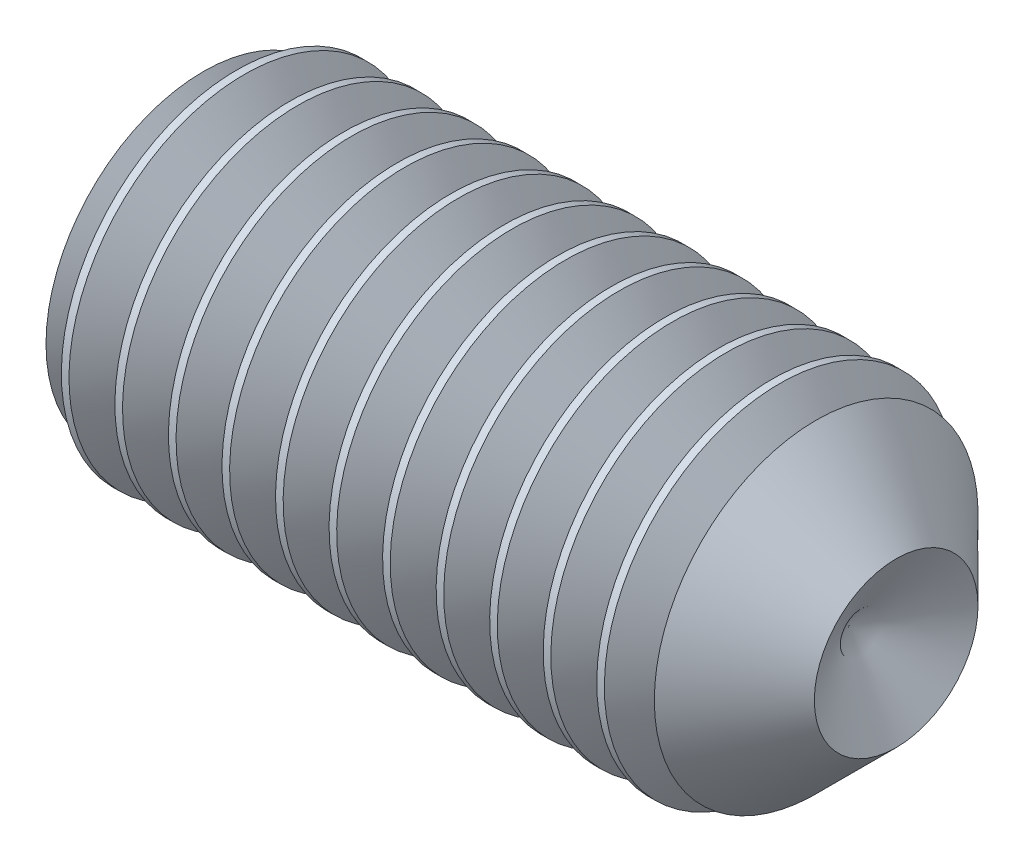
ISO-10303-21;
HEADER;
FILE_DESCRIPTION(('STEP AP214'),'2;1');
FILE_NAME('part.step','',(''),(''),'','','');
FILE_SCHEMA(('AUTOMOTIVE_DESIGN { 1 0 10303 214 1 1 1 1 }'));
ENDSEC;
DATA;
#1=APPLICATION_CONTEXT('core data for automotive mechanical design processes');
#2=APPLICATION_PROTOCOL_DEFINITION('international standard','automotive_design',2000,#1);
#3=PRODUCT_CONTEXT('',#1,'mechanical');
#4=PRODUCT('Part','Part','',(#3));
#5=PRODUCT_RELATED_PRODUCT_CATEGORY('part','',(#4));
#6=PRODUCT_DEFINITION_FORMATION('','',#4);
#7=PRODUCT_DEFINITION_CONTEXT('part definition',#1,'design');
#8=PRODUCT_DEFINITION('design','',#6,#7);
#9=PRODUCT_DEFINITION_SHAPE('','',#8);
#10=(LENGTH_UNIT() NAMED_UNIT(*) SI_UNIT(.MILLI.,.METRE.));
#11=(NAMED_UNIT(*) PLANE_ANGLE_UNIT() SI_UNIT($,.RADIAN.));
#12=(NAMED_UNIT(*) SI_UNIT($,.STERADIAN.) SOLID_ANGLE_UNIT());
#13=UNCERTAINTY_MEASURE_WITH_UNIT(LENGTH_MEASURE(1.E-05),#10,'distance_accuracy_value','');
#14=(GEOMETRIC_REPRESENTATION_CONTEXT(3) GLOBAL_UNCERTAINTY_ASSIGNED_CONTEXT((#13)) GLOBAL_UNIT_ASSIGNED_CONTEXT((#10,
#11,#12)) REPRESENTATION_CONTEXT('',''));
#15=CARTESIAN_POINT('',(0.,0.,0.));
#16=DIRECTION('',(0.,0.,1.));
#17=DIRECTION('',(1.,0.,0.));
#18=AXIS2_PLACEMENT_3D('',#15,#16,#17);
#19=CARTESIAN_POINT('',(0.,0.,0.));
#20=DIRECTION('',(-1.,0.,0.));
#21=DIRECTION('',(0.,0.,1.));
#22=AXIS2_PLACEMENT_3D('',#19,#20,#21);
#23=PLANE('',#22);
#24=CARTESIAN_POINT('',(0.,0.,0.));
#25=DIRECTION('',(-1.,0.,0.));
#26=DIRECTION('',(0.,0.,1.));
#27=AXIS2_PLACEMENT_3D('',#24,#25,#26);
#28=CIRCLE('',#27,1.2195);
#29=CARTESIAN_POINT('',(0.,0.,1.2195));
#30=VERTEX_POINT('',#29);
#31=EDGE_CURVE('E11',#30,#30,#28,.T.);
#32=ORIENTED_EDGE('',*,*,#31,.T.);
#33=EDGE_LOOP('',(#32));
#34=FACE_BOUND('',#33,.T.);
#35=DIRECTION('',(0.,0.,-1.));
#36=VECTOR('',#35,1.);
#37=CARTESIAN_POINT('',(0.,0.750000000000003,0.433012701892217));
#38=LINE('',#37,#36);
#39=CARTESIAN_POINT('',(0.,0.750000000000003,0.433012701892217));
#40=VERTEX_POINT('',#39);
#41=CARTESIAN_POINT('',(0.,0.750000000000003,-0.433012701892222));
#42=VERTEX_POINT('',#41);
#43=EDGE_CURVE('E99',#40,#42,#38,.T.);
#44=ORIENTED_EDGE('',*,*,#43,.F.);
#45=DIRECTION('',(0.,-0.866025403784439,0.5));
#46=VECTOR('',#45,1.);
#47=CARTESIAN_POINT('',(0.,0.750000000000003,0.433012701892217));
#48=LINE('',#47,#46);
#49=CARTESIAN_POINT('',(0.,0.,0.866025403784436));
#50=VERTEX_POINT('',#49);
#51=EDGE_CURVE('E52',#40,#50,#48,.T.);
#52=ORIENTED_EDGE('',*,*,#51,.T.);
#53=DIRECTION('',(0.,0.866025403784439,0.5));
#54=VECTOR('',#53,1.);
#55=CARTESIAN_POINT('',(0.,-0.749999999999997,0.433012701892217));
#56=LINE('',#55,#54);
#57=CARTESIAN_POINT('',(0.,-0.749999999999997,0.433012701892217));
#58=VERTEX_POINT('',#57);
#59=EDGE_CURVE('E105',#58,#50,#56,.T.);
#60=ORIENTED_EDGE('',*,*,#59,.F.);
#61=DIRECTION('',(0.,0.,-1.));
#62=VECTOR('',#61,1.);
#63=CARTESIAN_POINT('',(0.,-0.749999999999997,0.433012701892217));
#64=LINE('',#63,#62);
#65=CARTESIAN_POINT('',(0.,-0.749999999999997,-0.433012701892222));
#66=VERTEX_POINT('',#65);
#67=EDGE_CURVE('E126',#58,#66,#64,.T.);
#68=ORIENTED_EDGE('',*,*,#67,.T.);
#69=DIRECTION('',(0.,0.866025403784438,-0.5));
#70=VECTOR('',#69,1.);
#71=CARTESIAN_POINT('',(0.,-0.749999999999997,-0.433012701892222));
#72=LINE('',#71,#70);
#73=CARTESIAN_POINT('',(0.,0.,-0.866025403784442));
#74=VERTEX_POINT('',#73);
#75=EDGE_CURVE('E129',#66,#74,#72,.T.);
#76=ORIENTED_EDGE('',*,*,#75,.T.);
#77=DIRECTION('',(0.,-0.866025403784439,-0.5));
#78=VECTOR('',#77,1.);
#79=CARTESIAN_POINT('',(0.,0.750000000000003,-0.433012701892222));
#80=LINE('',#79,#78);
#81=EDGE_CURVE('E132',#42,#74,#80,.T.);
#82=ORIENTED_EDGE('',*,*,#81,.F.);
#83=EDGE_LOOP('',(#44,#52,#60,#68,#76,#82));
#84=FACE_BOUND('',#83,.T.);
#85=ADVANCED_FACE('F36',(#34,#84),#23,.T.);
#86=CARTESIAN_POINT('',(0.,0.,0.));
#87=DIRECTION('',(1.,0.,0.));
#88=DIRECTION('',(0.,0.,-1.));
#89=AXIS2_PLACEMENT_3D('',#86,#87,#88);
#90=CONICAL_SURFACE('',#89,1.2195,1.0471975511966);
#91=CARTESIAN_POINT('',(0.0731865121550397,0.,0.));
#92=DIRECTION('',(-1.,0.,0.));
#93=DIRECTION('',(0.,-1.,0.));
#94=AXIS2_PLACEMENT_3D('',#91,#92,#93);
#95=CIRCLE('',#94,1.34626275748129);
#96=CARTESIAN_POINT('',(0.0731865121550398,-1.34626275748129,0.));
#97=VERTEX_POINT('',#96);
#98=EDGE_CURVE('E124',#97,#97,#95,.F.);
#99=ORIENTED_EDGE('',*,*,#98,.F.);
#100=EDGE_LOOP('',(#99));
#101=FACE_BOUND('',#100,.T.);
#102=ORIENTED_EDGE('',*,*,#31,.F.);
#103=EDGE_LOOP('',(#102));
#104=FACE_BOUND('',#103,.T.);
#105=ADVANCED_FACE('F276',(#101,#104),#90,.T.);
#106=CARTESIAN_POINT('',(2.,0.750000000000003,0.433012701892217));
#107=DIRECTION('',(0.,-0.5,-0.866025403784439));
#108=DIRECTION('',(0.,0.866025403784439,-0.5));
#109=AXIS2_PLACEMENT_3D('',#106,#107,#108);
#110=PLANE('',#109);
#111=ORIENTED_EDGE('',*,*,#51,.F.);
#112=DIRECTION('',(-1.,0.,0.));
#113=VECTOR('',#112,1.);
#114=CARTESIAN_POINT('',(2.,0.750000000000003,0.433012701892217));
#115=LINE('',#114,#113);
#116=CARTESIAN_POINT('',(2.,0.750000000000003,0.433012701892217));
#117=VERTEX_POINT('',#116);
#118=EDGE_CURVE('E93',#117,#40,#115,.T.);
#119=ORIENTED_EDGE('',*,*,#118,.F.);
#120=DIRECTION('',(0.,-0.866025403784439,0.5));
#121=VECTOR('',#120,1.);
#122=CARTESIAN_POINT('',(2.,0.750000000000003,0.433012701892217));
#123=LINE('',#122,#121);
#124=CARTESIAN_POINT('',(2.,0.,0.866025403784436));
#125=VERTEX_POINT('',#124);
#126=EDGE_CURVE('E88',#117,#125,#123,.T.);
#127=ORIENTED_EDGE('',*,*,#126,.T.);
#128=DIRECTION('',(-1.,0.,0.));
#129=VECTOR('',#128,1.);
#130=CARTESIAN_POINT('',(2.,0.,0.866025403784436));
#131=LINE('',#130,#129);
#132=EDGE_CURVE('E91',#125,#50,#131,.T.);
#133=ORIENTED_EDGE('',*,*,#132,.T.);
#134=EDGE_LOOP('',(#111,#119,#127,#133));
#135=FACE_BOUND('',#134,.T.);
#136=ADVANCED_FACE('F90',(#135),#110,.T.);
#137=CARTESIAN_POINT('',(2.,-0.749999999999997,0.433012701892217));
#138=DIRECTION('',(0.,-0.5,0.866025403784439));
#139=DIRECTION('',(0.,-0.866025403784439,-0.5));
#140=AXIS2_PLACEMENT_3D('',#137,#138,#139);
#141=PLANE('',#140);
#142=ORIENTED_EDGE('',*,*,#59,.T.);
#143=ORIENTED_EDGE('',*,*,#132,.F.);
#144=DIRECTION('',(0.,0.866025403784439,0.5));
#145=VECTOR('',#144,1.);
#146=CARTESIAN_POINT('',(2.,-0.749999999999997,0.433012701892217));
#147=LINE('',#146,#145);
#148=CARTESIAN_POINT('',(2.,-0.749999999999997,0.433012701892217));
#149=VERTEX_POINT('',#148);
#150=EDGE_CURVE('E98',#149,#125,#147,.T.);
#151=ORIENTED_EDGE('',*,*,#150,.F.);
#152=DIRECTION('',(-1.,0.,0.));
#153=VECTOR('',#152,1.);
#154=CARTESIAN_POINT('',(2.,-0.749999999999997,0.433012701892217));
#155=LINE('',#154,#153);
#156=EDGE_CURVE('E106',#149,#58,#155,.T.);
#157=ORIENTED_EDGE('',*,*,#156,.T.);
#158=EDGE_LOOP('',(#142,#143,#151,#157));
#159=FACE_BOUND('',#158,.T.);
#160=ADVANCED_FACE('F103',(#159),#141,.F.);
#161=CARTESIAN_POINT('',(2.,-0.749999999999997,0.433012701892217));
#162=DIRECTION('',(0.,1.,0.));
#163=DIRECTION('',(0.,0.,1.));
#164=AXIS2_PLACEMENT_3D('',#161,#162,#163);
#165=PLANE('',#164);
#166=ORIENTED_EDGE('',*,*,#67,.F.);
#167=ORIENTED_EDGE('',*,*,#156,.F.);
#168=DIRECTION('',(0.,0.,-1.));
#169=VECTOR('',#168,1.);
#170=CARTESIAN_POINT('',(2.,-0.749999999999997,0.433012701892217));
#171=LINE('',#170,#169);
#172=CARTESIAN_POINT('',(2.,-0.749999999999997,-0.433012701892222));
#173=VERTEX_POINT('',#172);
#174=EDGE_CURVE('E111',#149,#173,#171,.T.);
#175=ORIENTED_EDGE('',*,*,#174,.T.);
#176=DIRECTION('',(-1.,0.,0.));
#177=VECTOR('',#176,1.);
#178=CARTESIAN_POINT('',(2.,-0.749999999999997,-0.433012701892222));
#179=LINE('',#178,#177);
#180=EDGE_CURVE('E142',#173,#66,#179,.T.);
#181=ORIENTED_EDGE('',*,*,#180,.T.);
#182=EDGE_LOOP('',(#166,#167,#175,#181));
#183=FACE_BOUND('',#182,.T.);
#184=ADVANCED_FACE('F298',(#183),#165,.T.);
#185=CARTESIAN_POINT('',(2.,-0.749999999999997,-0.433012701892222));
#186=DIRECTION('',(0.,0.5,0.866025403784438));
#187=DIRECTION('',(0.,-0.866025403784439,0.5));
#188=AXIS2_PLACEMENT_3D('',#185,#186,#187);
#189=PLANE('',#188);
#190=ORIENTED_EDGE('',*,*,#75,.F.);
#191=ORIENTED_EDGE('',*,*,#180,.F.);
#192=DIRECTION('',(0.,0.866025403784438,-0.5));
#193=VECTOR('',#192,1.);
#194=CARTESIAN_POINT('',(2.,-0.749999999999997,-0.433012701892222));
#195=LINE('',#194,#193);
#196=CARTESIAN_POINT('',(2.,0.,-0.866025403784442));
#197=VERTEX_POINT('',#196);
#198=EDGE_CURVE('E113',#173,#197,#195,.T.);
#199=ORIENTED_EDGE('',*,*,#198,.T.);
#200=DIRECTION('',(-1.,0.,0.));
#201=VECTOR('',#200,1.);
#202=CARTESIAN_POINT('',(2.,0.,-0.866025403784442));
#203=LINE('',#202,#201);
#204=EDGE_CURVE('E140',#197,#74,#203,.T.);
#205=ORIENTED_EDGE('',*,*,#204,.T.);
#206=EDGE_LOOP('',(#190,#191,#199,#205));
#207=FACE_BOUND('',#206,.T.);
#208=ADVANCED_FACE('F294',(#207),#189,.T.);
#209=CARTESIAN_POINT('',(2.,0.750000000000003,-0.433012701892222));
#210=DIRECTION('',(0.,0.5,-0.866025403784439));
#211=DIRECTION('',(0.,0.866025403784439,0.5));
#212=AXIS2_PLACEMENT_3D('',#209,#210,#211);
#213=PLANE('',#212);
#214=ORIENTED_EDGE('',*,*,#81,.T.);
#215=ORIENTED_EDGE('',*,*,#204,.F.);
#216=DIRECTION('',(0.,-0.866025403784439,-0.5));
#217=VECTOR('',#216,1.);
#218=CARTESIAN_POINT('',(2.,0.750000000000003,-0.433012701892222));
#219=LINE('',#218,#217);
#220=CARTESIAN_POINT('',(2.,0.750000000000003,-0.433012701892222));
#221=VERTEX_POINT('',#220);
#222=EDGE_CURVE('E118',#221,#197,#219,.T.);
#223=ORIENTED_EDGE('',*,*,#222,.F.);
#224=DIRECTION('',(-1.,0.,0.));
#225=VECTOR('',#224,1.);
#226=CARTESIAN_POINT('',(2.,0.750000000000003,-0.433012701892222));
#227=LINE('',#226,#225);
#228=EDGE_CURVE('E138',#221,#42,#227,.T.);
#229=ORIENTED_EDGE('',*,*,#228,.T.);
#230=EDGE_LOOP('',(#214,#215,#223,#229));
#231=FACE_BOUND('',#230,.T.);
#232=ADVANCED_FACE('F291',(#231),#213,.F.);
#233=CARTESIAN_POINT('',(2.,0.750000000000003,0.433012701892217));
#234=DIRECTION('',(0.,1.,0.));
#235=DIRECTION('',(0.,0.,1.));
#236=AXIS2_PLACEMENT_3D('',#233,#234,#235);
#237=PLANE('',#236);
#238=ORIENTED_EDGE('',*,*,#43,.T.);
#239=ORIENTED_EDGE('',*,*,#228,.F.);
#240=DIRECTION('',(0.,0.,-1.));
#241=VECTOR('',#240,1.);
#242=CARTESIAN_POINT('',(2.,0.750000000000003,0.433012701892217));
#243=LINE('',#242,#241);
#244=EDGE_CURVE('E121',#117,#221,#243,.T.);
#245=ORIENTED_EDGE('',*,*,#244,.F.);
#246=ORIENTED_EDGE('',*,*,#118,.T.);
#247=EDGE_LOOP('',(#238,#239,#245,#246));
#248=FACE_BOUND('',#247,.T.);
#249=ADVANCED_FACE('F287',(#248),#237,.F.);
#250=CARTESIAN_POINT('',(2.,-0.749999999999997,1.29903810567666));
#251=DIRECTION('',(1.,0.,0.));
#252=DIRECTION('',(0.,0.,-1.));
#253=AXIS2_PLACEMENT_3D('',#250,#251,#252);
#254=PLANE('',#253);
#255=ORIENTED_EDGE('',*,*,#126,.F.);
#256=ORIENTED_EDGE('',*,*,#244,.T.);
#257=ORIENTED_EDGE('',*,*,#222,.T.);
#258=ORIENTED_EDGE('',*,*,#198,.F.);
#259=ORIENTED_EDGE('',*,*,#174,.F.);
#260=ORIENTED_EDGE('',*,*,#150,.T.);
#261=EDGE_LOOP('',(#255,#256,#257,#258,#259,#260));
#262=FACE_BOUND('',#261,.T.);
#263=ADVANCED_FACE('F109',(#262),#254,.F.);
#264=CARTESIAN_POINT('',(0.358354964975514,0.,0.));
#265=DIRECTION('',(1.,0.,0.));
#266=DIRECTION('',(0.,1.,0.));
#267=AXIS2_PLACEMENT_3D('',#264,#265,#266);
#268=CONICAL_SURFACE('',#267,1.5,0.959931088596882);
#269=CARTESIAN_POINT('',(0.161946750507689,0.,0.));
#270=DIRECTION('',(-1.,0.,0.));
#271=DIRECTION('',(0.,-1.,0.));
#272=AXIS2_PLACEMENT_3D('',#269,#270,#271);
#273=CIRCLE('',#272,1.2195);
#274=CARTESIAN_POINT('',(0.161946750507689,-1.2195,0.));
#275=VERTEX_POINT('',#274);
#276=EDGE_CURVE('E151',#275,#275,#273,.T.);
#277=ORIENTED_EDGE('',*,*,#276,.F.);
#278=EDGE_LOOP('',(#277));
#279=FACE_BOUND('',#278,.T.);
#280=CARTESIAN_POINT('',(0.358354964975514,0.,0.));
#281=DIRECTION('',(-1.,0.,0.));
#282=DIRECTION('',(0.,-1.,0.));
#283=AXIS2_PLACEMENT_3D('',#280,#281,#282);
#284=CIRCLE('',#283,1.5);
#285=CARTESIAN_POINT('',(0.358354964975514,-1.5,0.));
#286=VERTEX_POINT('',#285);
#287=EDGE_CURVE('E147',#286,#286,#284,.T.);
#288=ORIENTED_EDGE('',*,*,#287,.T.);
#289=EDGE_LOOP('',(#288));
#290=FACE_BOUND('',#289,.T.);
#291=ADVANCED_FACE('F329',(#279,#290),#268,.T.);
#292=CARTESIAN_POINT('',(0.161946750507689,0.,0.));
#293=DIRECTION('',(-1.,0.,0.));
#294=DIRECTION('',(0.,-1.,0.));
#295=AXIS2_PLACEMENT_3D('',#292,#293,#294);
#296=CONICAL_SURFACE('',#295,1.2195,0.959931088596877);
#297=ORIENTED_EDGE('',*,*,#98,.T.);
#298=EDGE_LOOP('',(#297));
#299=FACE_BOUND('',#298,.T.);
#300=ORIENTED_EDGE('',*,*,#276,.T.);
#301=EDGE_LOOP('',(#300));
#302=FACE_BOUND('',#301,.T.);
#303=ADVANCED_FACE('F319',(#299,#302),#296,.T.);
#304=CARTESIAN_POINT('',(-12.7,0.,0.));
#305=DIRECTION('',(-1.,0.,0.));
#306=DIRECTION('',(0.,0.,1.));
#307=AXIS2_PLACEMENT_3D('',#304,#305,#306);
#308=CYLINDRICAL_SURFACE('',#307,1.5);
#309=CARTESIAN_POINT('',(0.423543379245379,0.,0.));
#310=DIRECTION('',(-1.,0.,0.));
#311=DIRECTION('',(0.,-1.,0.));
#312=AXIS2_PLACEMENT_3D('',#309,#310,#311);
#313=CIRCLE('',#312,1.5);
#314=CARTESIAN_POINT('',(0.423543379245379,-1.5,0.));
#315=VERTEX_POINT('',#314);
#316=EDGE_CURVE('E160',#315,#315,#313,.T.);
#317=ORIENTED_EDGE('',*,*,#316,.T.);
#318=EDGE_LOOP('',(#317));
#319=FACE_BOUND('',#318,.T.);
#320=ORIENTED_EDGE('',*,*,#287,.F.);
#321=EDGE_LOOP('',(#320));
#322=FACE_BOUND('',#321,.T.);
#323=ADVANCED_FACE('F272',(#319,#322),#308,.T.);
#324=CARTESIAN_POINT('',(0.816359808181032,0.,0.));
#325=DIRECTION('',(1.,0.,0.));
#326=DIRECTION('',(0.,1.,0.));
#327=AXIS2_PLACEMENT_3D('',#324,#325,#326);
#328=CONICAL_SURFACE('',#327,1.5,0.959931088596882);
#329=CARTESIAN_POINT('',(0.619951593713207,0.,0.));
#330=DIRECTION('',(-1.,0.,0.));
#331=DIRECTION('',(0.,-1.,0.));
#332=AXIS2_PLACEMENT_3D('',#329,#330,#331);
#333=CIRCLE('',#332,1.2195);
#334=CARTESIAN_POINT('',(0.619951593713207,-1.2195,0.));
#335=VERTEX_POINT('',#334);
#336=EDGE_CURVE('E163',#335,#335,#333,.T.);
#337=ORIENTED_EDGE('',*,*,#336,.F.);
#338=EDGE_LOOP('',(#337));
#339=FACE_BOUND('',#338,.T.);
#340=CARTESIAN_POINT('',(0.816359808181032,0.,0.));
#341=DIRECTION('',(-1.,0.,0.));
#342=DIRECTION('',(0.,-1.,0.));
#343=AXIS2_PLACEMENT_3D('',#340,#341,#342);
#344=CIRCLE('',#343,1.5);
#345=CARTESIAN_POINT('',(0.816359808181032,-1.5,0.));
#346=VERTEX_POINT('',#345);
#347=EDGE_CURVE('E155',#346,#346,#344,.T.);
#348=ORIENTED_EDGE('',*,*,#347,.T.);
#349=EDGE_LOOP('',(#348));
#350=FACE_BOUND('',#349,.T.);
#351=ADVANCED_FACE('F318',(#339,#350),#328,.T.);
#352=CARTESIAN_POINT('',(0.619951593713207,0.,0.));
#353=DIRECTION('',(-1.,0.,0.));
#354=DIRECTION('',(0.,-1.,0.));
#355=AXIS2_PLACEMENT_3D('',#352,#353,#354);
#356=CONICAL_SURFACE('',#355,1.2195,0.959931088596877);
#357=ORIENTED_EDGE('',*,*,#316,.F.);
#358=EDGE_LOOP('',(#357));
#359=FACE_BOUND('',#358,.T.);
#360=ORIENTED_EDGE('',*,*,#336,.T.);
#361=EDGE_LOOP('',(#360));
#362=FACE_BOUND('',#361,.T.);
#363=ADVANCED_FACE('F326',(#359,#362),#356,.T.);
#364=CARTESIAN_POINT('',(0.881548222450898,0.,0.));
#365=DIRECTION('',(-1.,0.,0.));
#366=DIRECTION('',(0.,-1.,0.));
#367=AXIS2_PLACEMENT_3D('',#364,#365,#366);
#368=CIRCLE('',#367,1.5);
#369=CARTESIAN_POINT('',(0.881548222450898,-1.5,0.));
#370=VERTEX_POINT('',#369);
#371=EDGE_CURVE('E169',#370,#370,#368,.T.);
#372=ORIENTED_EDGE('',*,*,#371,.T.);
#373=EDGE_LOOP('',(#372));
#374=FACE_BOUND('',#373,.T.);
#375=ORIENTED_EDGE('',*,*,#347,.F.);
#376=EDGE_LOOP('',(#375));
#377=FACE_BOUND('',#376,.T.);
#378=ADVANCED_FACE('F321',(#374,#377),#308,.T.);
#379=CARTESIAN_POINT('',(1.27436465138655,0.,0.));
#380=DIRECTION('',(1.,0.,0.));
#381=DIRECTION('',(0.,1.,0.));
#382=AXIS2_PLACEMENT_3D('',#379,#380,#381);
#383=CONICAL_SURFACE('',#382,1.5,0.959931088596882);
#384=CARTESIAN_POINT('',(1.07795643691873,0.,0.));
#385=DIRECTION('',(-1.,0.,0.));
#386=DIRECTION('',(0.,-1.,0.));
#387=AXIS2_PLACEMENT_3D('',#384,#385,#386);
#388=CIRCLE('',#387,1.2195);
#389=CARTESIAN_POINT('',(1.07795643691873,-1.2195,0.));
#390=VERTEX_POINT('',#389);
#391=EDGE_CURVE('E172',#390,#390,#388,.T.);
#392=ORIENTED_EDGE('',*,*,#391,.F.);
#393=EDGE_LOOP('',(#392));
#394=FACE_BOUND('',#393,.T.);
#395=CARTESIAN_POINT('',(1.27436465138655,0.,0.));
#396=DIRECTION('',(-1.,0.,0.));
#397=DIRECTION('',(0.,-1.,0.));
#398=AXIS2_PLACEMENT_3D('',#395,#396,#397);
#399=CIRCLE('',#398,1.5);
#400=CARTESIAN_POINT('',(1.27436465138655,-1.5,0.));
#401=VERTEX_POINT('',#400);
#402=EDGE_CURVE('E166',#401,#401,#399,.T.);
#403=ORIENTED_EDGE('',*,*,#402,.T.);
#404=EDGE_LOOP('',(#403));
#405=FACE_BOUND('',#404,.T.);
#406=ADVANCED_FACE('F333',(#394,#405),#383,.T.);
#407=CARTESIAN_POINT('',(1.07795643691873,0.,0.));
#408=DIRECTION('',(-1.,0.,0.));
#409=DIRECTION('',(0.,-1.,0.));
#410=AXIS2_PLACEMENT_3D('',#407,#408,#409);
#411=CONICAL_SURFACE('',#410,1.2195,0.959931088596877);
#412=ORIENTED_EDGE('',*,*,#371,.F.);
#413=EDGE_LOOP('',(#412));
#414=FACE_BOUND('',#413,.T.);
#415=ORIENTED_EDGE('',*,*,#391,.T.);
#416=EDGE_LOOP('',(#415));
#417=FACE_BOUND('',#416,.T.);
#418=ADVANCED_FACE('F340',(#414,#417),#411,.T.);
#419=CARTESIAN_POINT('',(1.33955306565642,0.,0.));
#420=DIRECTION('',(-1.,0.,0.));
#421=DIRECTION('',(0.,-1.,0.));
#422=AXIS2_PLACEMENT_3D('',#419,#420,#421);
#423=CIRCLE('',#422,1.5);
#424=CARTESIAN_POINT('',(1.33955306565642,-1.5,0.));
#425=VERTEX_POINT('',#424);
#426=EDGE_CURVE('E178',#425,#425,#423,.T.);
#427=ORIENTED_EDGE('',*,*,#426,.T.);
#428=EDGE_LOOP('',(#427));
#429=FACE_BOUND('',#428,.T.);
#430=ORIENTED_EDGE('',*,*,#402,.F.);
#431=EDGE_LOOP('',(#430));
#432=FACE_BOUND('',#431,.T.);
#433=ADVANCED_FACE('F335',(#429,#432),#308,.T.);
#434=CARTESIAN_POINT('',(1.73236949459207,0.,0.));
#435=DIRECTION('',(1.,0.,0.));
#436=DIRECTION('',(0.,1.,0.));
#437=AXIS2_PLACEMENT_3D('',#434,#435,#436);
#438=CONICAL_SURFACE('',#437,1.5,0.959931088596882);
#439=CARTESIAN_POINT('',(1.53596128012424,0.,0.));
#440=DIRECTION('',(-1.,0.,0.));
#441=DIRECTION('',(0.,-1.,0.));
#442=AXIS2_PLACEMENT_3D('',#439,#440,#441);
#443=CIRCLE('',#442,1.2195);
#444=CARTESIAN_POINT('',(1.53596128012424,-1.2195,0.));
#445=VERTEX_POINT('',#444);
#446=EDGE_CURVE('E181',#445,#445,#443,.T.);
#447=ORIENTED_EDGE('',*,*,#446,.F.);
#448=EDGE_LOOP('',(#447));
#449=FACE_BOUND('',#448,.T.);
#450=CARTESIAN_POINT('',(1.73236949459207,0.,0.));
#451=DIRECTION('',(-1.,0.,0.));
#452=DIRECTION('',(0.,-1.,0.));
#453=AXIS2_PLACEMENT_3D('',#450,#451,#452);
#454=CIRCLE('',#453,1.5);
#455=CARTESIAN_POINT('',(1.73236949459207,-1.5,0.));
#456=VERTEX_POINT('',#455);
#457=EDGE_CURVE('E175',#456,#456,#454,.T.);
#458=ORIENTED_EDGE('',*,*,#457,.T.);
#459=EDGE_LOOP('',(#458));
#460=FACE_BOUND('',#459,.T.);
#461=ADVANCED_FACE('F347',(#449,#460),#438,.T.);
#462=CARTESIAN_POINT('',(1.53596128012424,0.,0.));
#463=DIRECTION('',(-1.,0.,0.));
#464=DIRECTION('',(0.,-1.,0.));
#465=AXIS2_PLACEMENT_3D('',#462,#463,#464);
#466=CONICAL_SURFACE('',#465,1.2195,0.959931088596877);
#467=ORIENTED_EDGE('',*,*,#426,.F.);
#468=EDGE_LOOP('',(#467));
#469=FACE_BOUND('',#468,.T.);
#470=ORIENTED_EDGE('',*,*,#446,.T.);
#471=EDGE_LOOP('',(#470));
#472=FACE_BOUND('',#471,.T.);
#473=ADVANCED_FACE('F354',(#469,#472),#466,.T.);
#474=CARTESIAN_POINT('',(1.79755790886193,0.,0.));
#475=DIRECTION('',(-1.,0.,0.));
#476=DIRECTION('',(0.,-1.,0.));
#477=AXIS2_PLACEMENT_3D('',#474,#475,#476);
#478=CIRCLE('',#477,1.5);
#479=CARTESIAN_POINT('',(1.79755790886193,-1.5,0.));
#480=VERTEX_POINT('',#479);
#481=EDGE_CURVE('E187',#480,#480,#478,.T.);
#482=ORIENTED_EDGE('',*,*,#481,.T.);
#483=EDGE_LOOP('',(#482));
#484=FACE_BOUND('',#483,.T.);
#485=ORIENTED_EDGE('',*,*,#457,.F.);
#486=EDGE_LOOP('',(#485));
#487=FACE_BOUND('',#486,.T.);
#488=ADVANCED_FACE('F349',(#484,#487),#308,.T.);
#489=CARTESIAN_POINT('',(2.19037433779759,0.,0.));
#490=DIRECTION('',(1.,0.,0.));
#491=DIRECTION('',(0.,1.,0.));
#492=AXIS2_PLACEMENT_3D('',#489,#490,#491);
#493=CONICAL_SURFACE('',#492,1.5,0.959931088596882);
#494=CARTESIAN_POINT('',(1.99396612332976,0.,0.));
#495=DIRECTION('',(-1.,0.,0.));
#496=DIRECTION('',(0.,-1.,0.));
#497=AXIS2_PLACEMENT_3D('',#494,#495,#496);
#498=CIRCLE('',#497,1.2195);
#499=CARTESIAN_POINT('',(1.99396612332976,-1.2195,0.));
#500=VERTEX_POINT('',#499);
#501=EDGE_CURVE('E190',#500,#500,#498,.T.);
#502=ORIENTED_EDGE('',*,*,#501,.F.);
#503=EDGE_LOOP('',(#502));
#504=FACE_BOUND('',#503,.T.);
#505=CARTESIAN_POINT('',(2.19037433779759,0.,0.));
#506=DIRECTION('',(-1.,0.,0.));
#507=DIRECTION('',(0.,-1.,0.));
#508=AXIS2_PLACEMENT_3D('',#505,#506,#507);
#509=CIRCLE('',#508,1.5);
#510=CARTESIAN_POINT('',(2.19037433779759,-1.5,0.));
#511=VERTEX_POINT('',#510);
#512=EDGE_CURVE('E184',#511,#511,#509,.T.);
#513=ORIENTED_EDGE('',*,*,#512,.T.);
#514=EDGE_LOOP('',(#513));
#515=FACE_BOUND('',#514,.T.);
#516=ADVANCED_FACE('F361',(#504,#515),#493,.T.);
#517=CARTESIAN_POINT('',(1.99396612332976,0.,0.));
#518=DIRECTION('',(-1.,0.,0.));
#519=DIRECTION('',(0.,-1.,0.));
#520=AXIS2_PLACEMENT_3D('',#517,#518,#519);
#521=CONICAL_SURFACE('',#520,1.2195,0.959931088596877);
#522=ORIENTED_EDGE('',*,*,#481,.F.);
#523=EDGE_LOOP('',(#522));
#524=FACE_BOUND('',#523,.T.);
#525=ORIENTED_EDGE('',*,*,#501,.T.);
#526=EDGE_LOOP('',(#525));
#527=FACE_BOUND('',#526,.T.);
#528=ADVANCED_FACE('F368',(#524,#527),#521,.T.);
#529=CARTESIAN_POINT('',(2.25556275206745,0.,0.));
#530=DIRECTION('',(-1.,0.,0.));
#531=DIRECTION('',(0.,-1.,0.));
#532=AXIS2_PLACEMENT_3D('',#529,#530,#531);
#533=CIRCLE('',#532,1.5);
#534=CARTESIAN_POINT('',(2.25556275206745,-1.5,0.));
#535=VERTEX_POINT('',#534);
#536=EDGE_CURVE('E196',#535,#535,#533,.T.);
#537=ORIENTED_EDGE('',*,*,#536,.T.);
#538=EDGE_LOOP('',(#537));
#539=FACE_BOUND('',#538,.T.);
#540=ORIENTED_EDGE('',*,*,#512,.F.);
#541=EDGE_LOOP('',(#540));
#542=FACE_BOUND('',#541,.T.);
#543=ADVANCED_FACE('F363',(#539,#542),#308,.T.);
#544=CARTESIAN_POINT('',(2.64837918100311,0.,0.));
#545=DIRECTION('',(1.,0.,0.));
#546=DIRECTION('',(0.,1.,0.));
#547=AXIS2_PLACEMENT_3D('',#544,#545,#546);
#548=CONICAL_SURFACE('',#547,1.5,0.959931088596882);
#549=CARTESIAN_POINT('',(2.45197096653528,0.,0.));
#550=DIRECTION('',(-1.,0.,0.));
#551=DIRECTION('',(0.,-1.,0.));
#552=AXIS2_PLACEMENT_3D('',#549,#550,#551);
#553=CIRCLE('',#552,1.2195);
#554=CARTESIAN_POINT('',(2.45197096653528,-1.2195,0.));
#555=VERTEX_POINT('',#554);
#556=EDGE_CURVE('E199',#555,#555,#553,.T.);
#557=ORIENTED_EDGE('',*,*,#556,.F.);
#558=EDGE_LOOP('',(#557));
#559=FACE_BOUND('',#558,.T.);
#560=CARTESIAN_POINT('',(2.64837918100311,0.,0.));
#561=DIRECTION('',(-1.,0.,0.));
#562=DIRECTION('',(0.,-1.,0.));
#563=AXIS2_PLACEMENT_3D('',#560,#561,#562);
#564=CIRCLE('',#563,1.5);
#565=CARTESIAN_POINT('',(2.64837918100311,-1.5,0.));
#566=VERTEX_POINT('',#565);
#567=EDGE_CURVE('E193',#566,#566,#564,.T.);
#568=ORIENTED_EDGE('',*,*,#567,.T.);
#569=EDGE_LOOP('',(#568));
#570=FACE_BOUND('',#569,.T.);
#571=ADVANCED_FACE('F375',(#559,#570),#548,.T.);
#572=CARTESIAN_POINT('',(2.45197096653528,0.,0.));
#573=DIRECTION('',(-1.,0.,0.));
#574=DIRECTION('',(0.,-1.,0.));
#575=AXIS2_PLACEMENT_3D('',#572,#573,#574);
#576=CONICAL_SURFACE('',#575,1.2195,0.959931088596877);
#577=ORIENTED_EDGE('',*,*,#536,.F.);
#578=EDGE_LOOP('',(#577));
#579=FACE_BOUND('',#578,.T.);
#580=ORIENTED_EDGE('',*,*,#556,.T.);
#581=EDGE_LOOP('',(#580));
#582=FACE_BOUND('',#581,.T.);
#583=ADVANCED_FACE('F382',(#579,#582),#576,.T.);
#584=CARTESIAN_POINT('',(2.71356759527297,0.,0.));
#585=DIRECTION('',(-1.,0.,0.));
#586=DIRECTION('',(0.,-1.,0.));
#587=AXIS2_PLACEMENT_3D('',#584,#585,#586);
#588=CIRCLE('',#587,1.5);
#589=CARTESIAN_POINT('',(2.71356759527297,-1.5,0.));
#590=VERTEX_POINT('',#589);
#591=EDGE_CURVE('E205',#590,#590,#588,.T.);
#592=ORIENTED_EDGE('',*,*,#591,.T.);
#593=EDGE_LOOP('',(#592));
#594=FACE_BOUND('',#593,.T.);
#595=ORIENTED_EDGE('',*,*,#567,.F.);
#596=EDGE_LOOP('',(#595));
#597=FACE_BOUND('',#596,.T.);
#598=ADVANCED_FACE('F377',(#594,#597),#308,.T.);
#599=CARTESIAN_POINT('',(3.10638402420862,0.,0.));
#600=DIRECTION('',(1.,0.,0.));
#601=DIRECTION('',(0.,1.,0.));
#602=AXIS2_PLACEMENT_3D('',#599,#600,#601);
#603=CONICAL_SURFACE('',#602,1.5,0.959931088596882);
#604=CARTESIAN_POINT('',(2.9099758097408,0.,0.));
#605=DIRECTION('',(-1.,0.,0.));
#606=DIRECTION('',(0.,-1.,0.));
#607=AXIS2_PLACEMENT_3D('',#604,#605,#606);
#608=CIRCLE('',#607,1.2195);
#609=CARTESIAN_POINT('',(2.9099758097408,-1.2195,0.));
#610=VERTEX_POINT('',#609);
#611=EDGE_CURVE('E208',#610,#610,#608,.T.);
#612=ORIENTED_EDGE('',*,*,#611,.F.);
#613=EDGE_LOOP('',(#612));
#614=FACE_BOUND('',#613,.T.);
#615=CARTESIAN_POINT('',(3.10638402420862,0.,0.));
#616=DIRECTION('',(-1.,0.,0.));
#617=DIRECTION('',(0.,-1.,0.));
#618=AXIS2_PLACEMENT_3D('',#615,#616,#617);
#619=CIRCLE('',#618,1.5);
#620=CARTESIAN_POINT('',(3.10638402420862,-1.5,0.));
#621=VERTEX_POINT('',#620);
#622=EDGE_CURVE('E202',#621,#621,#619,.T.);
#623=ORIENTED_EDGE('',*,*,#622,.T.);
#624=EDGE_LOOP('',(#623));
#625=FACE_BOUND('',#624,.T.);
#626=ADVANCED_FACE('F389',(#614,#625),#603,.T.);
#627=CARTESIAN_POINT('',(2.9099758097408,0.,0.));
#628=DIRECTION('',(-1.,0.,0.));
#629=DIRECTION('',(0.,-1.,0.));
#630=AXIS2_PLACEMENT_3D('',#627,#628,#629);
#631=CONICAL_SURFACE('',#630,1.2195,0.959931088596877);
#632=ORIENTED_EDGE('',*,*,#591,.F.);
#633=EDGE_LOOP('',(#632));
#634=FACE_BOUND('',#633,.T.);
#635=ORIENTED_EDGE('',*,*,#611,.T.);
#636=EDGE_LOOP('',(#635));
#637=FACE_BOUND('',#636,.T.);
#638=ADVANCED_FACE('F396',(#634,#637),#631,.T.);
#639=CARTESIAN_POINT('',(3.17157243847849,0.,0.));
#640=DIRECTION('',(-1.,0.,0.));
#641=DIRECTION('',(0.,-1.,0.));
#642=AXIS2_PLACEMENT_3D('',#639,#640,#641);
#643=CIRCLE('',#642,1.5);
#644=CARTESIAN_POINT('',(3.17157243847849,-1.5,0.));
#645=VERTEX_POINT('',#644);
#646=EDGE_CURVE('E214',#645,#645,#643,.T.);
#647=ORIENTED_EDGE('',*,*,#646,.T.);
#648=EDGE_LOOP('',(#647));
#649=FACE_BOUND('',#648,.T.);
#650=ORIENTED_EDGE('',*,*,#622,.F.);
#651=EDGE_LOOP('',(#650));
#652=FACE_BOUND('',#651,.T.);
#653=ADVANCED_FACE('F391',(#649,#652),#308,.T.);
#654=CARTESIAN_POINT('',(3.56438886741414,0.,0.));
#655=DIRECTION('',(1.,0.,0.));
#656=DIRECTION('',(0.,1.,0.));
#657=AXIS2_PLACEMENT_3D('',#654,#655,#656);
#658=CONICAL_SURFACE('',#657,1.5,0.959931088596882);
#659=CARTESIAN_POINT('',(3.36798065294632,0.,0.));
#660=DIRECTION('',(-1.,0.,0.));
#661=DIRECTION('',(0.,-1.,0.));
#662=AXIS2_PLACEMENT_3D('',#659,#660,#661);
#663=CIRCLE('',#662,1.2195);
#664=CARTESIAN_POINT('',(3.36798065294632,-1.2195,0.));
#665=VERTEX_POINT('',#664);
#666=EDGE_CURVE('E217',#665,#665,#663,.T.);
#667=ORIENTED_EDGE('',*,*,#666,.F.);
#668=EDGE_LOOP('',(#667));
#669=FACE_BOUND('',#668,.T.);
#670=CARTESIAN_POINT('',(3.56438886741414,0.,0.));
#671=DIRECTION('',(-1.,0.,0.));
#672=DIRECTION('',(0.,-1.,0.));
#673=AXIS2_PLACEMENT_3D('',#670,#671,#672);
#674=CIRCLE('',#673,1.5);
#675=CARTESIAN_POINT('',(3.56438886741414,-1.5,0.));
#676=VERTEX_POINT('',#675);
#677=EDGE_CURVE('E211',#676,#676,#674,.T.);
#678=ORIENTED_EDGE('',*,*,#677,.T.);
#679=EDGE_LOOP('',(#678));
#680=FACE_BOUND('',#679,.T.);
#681=ADVANCED_FACE('F403',(#669,#680),#658,.T.);
#682=CARTESIAN_POINT('',(3.36798065294632,0.,0.));
#683=DIRECTION('',(-1.,0.,0.));
#684=DIRECTION('',(0.,-1.,0.));
#685=AXIS2_PLACEMENT_3D('',#682,#683,#684);
#686=CONICAL_SURFACE('',#685,1.2195,0.959931088596877);
#687=ORIENTED_EDGE('',*,*,#646,.F.);
#688=EDGE_LOOP('',(#687));
#689=FACE_BOUND('',#688,.T.);
#690=ORIENTED_EDGE('',*,*,#666,.T.);
#691=EDGE_LOOP('',(#690));
#692=FACE_BOUND('',#691,.T.);
#693=ADVANCED_FACE('F410',(#689,#692),#686,.T.);
#694=CARTESIAN_POINT('',(3.62957728168401,0.,0.));
#695=DIRECTION('',(-1.,0.,0.));
#696=DIRECTION('',(0.,-1.,0.));
#697=AXIS2_PLACEMENT_3D('',#694,#695,#696);
#698=CIRCLE('',#697,1.5);
#699=CARTESIAN_POINT('',(3.62957728168401,-1.5,0.));
#700=VERTEX_POINT('',#699);
#701=EDGE_CURVE('E223',#700,#700,#698,.T.);
#702=ORIENTED_EDGE('',*,*,#701,.T.);
#703=EDGE_LOOP('',(#702));
#704=FACE_BOUND('',#703,.T.);
#705=ORIENTED_EDGE('',*,*,#677,.F.);
#706=EDGE_LOOP('',(#705));
#707=FACE_BOUND('',#706,.T.);
#708=ADVANCED_FACE('F405',(#704,#707),#308,.T.);
#709=CARTESIAN_POINT('',(4.02239371061966,0.,0.));
#710=DIRECTION('',(1.,0.,0.));
#711=DIRECTION('',(0.,1.,0.));
#712=AXIS2_PLACEMENT_3D('',#709,#710,#711);
#713=CONICAL_SURFACE('',#712,1.5,0.959931088596882);
#714=CARTESIAN_POINT('',(3.82598549615183,0.,0.));
#715=DIRECTION('',(-1.,0.,0.));
#716=DIRECTION('',(0.,-1.,0.));
#717=AXIS2_PLACEMENT_3D('',#714,#715,#716);
#718=CIRCLE('',#717,1.2195);
#719=CARTESIAN_POINT('',(3.82598549615183,-1.2195,0.));
#720=VERTEX_POINT('',#719);
#721=EDGE_CURVE('E226',#720,#720,#718,.T.);
#722=ORIENTED_EDGE('',*,*,#721,.F.);
#723=EDGE_LOOP('',(#722));
#724=FACE_BOUND('',#723,.T.);
#725=CARTESIAN_POINT('',(4.02239371061966,0.,0.));
#726=DIRECTION('',(-1.,0.,0.));
#727=DIRECTION('',(0.,-1.,0.));
#728=AXIS2_PLACEMENT_3D('',#725,#726,#727);
#729=CIRCLE('',#728,1.5);
#730=CARTESIAN_POINT('',(4.02239371061966,-1.5,0.));
#731=VERTEX_POINT('',#730);
#732=EDGE_CURVE('E220',#731,#731,#729,.T.);
#733=ORIENTED_EDGE('',*,*,#732,.T.);
#734=EDGE_LOOP('',(#733));
#735=FACE_BOUND('',#734,.T.);
#736=ADVANCED_FACE('F417',(#724,#735),#713,.T.);
#737=CARTESIAN_POINT('',(3.82598549615183,0.,0.));
#738=DIRECTION('',(-1.,0.,0.));
#739=DIRECTION('',(0.,-1.,0.));
#740=AXIS2_PLACEMENT_3D('',#737,#738,#739);
#741=CONICAL_SURFACE('',#740,1.2195,0.959931088596877);
#742=ORIENTED_EDGE('',*,*,#701,.F.);
#743=EDGE_LOOP('',(#742));
#744=FACE_BOUND('',#743,.T.);
#745=ORIENTED_EDGE('',*,*,#721,.T.);
#746=EDGE_LOOP('',(#745));
#747=FACE_BOUND('',#746,.T.);
#748=ADVANCED_FACE('F424',(#744,#747),#741,.T.);
#749=CARTESIAN_POINT('',(4.08758212488952,0.,0.));
#750=DIRECTION('',(-1.,0.,0.));
#751=DIRECTION('',(0.,-1.,0.));
#752=AXIS2_PLACEMENT_3D('',#749,#750,#751);
#753=CIRCLE('',#752,1.5);
#754=CARTESIAN_POINT('',(4.08758212488952,-1.5,0.));
#755=VERTEX_POINT('',#754);
#756=EDGE_CURVE('E232',#755,#755,#753,.T.);
#757=ORIENTED_EDGE('',*,*,#756,.T.);
#758=EDGE_LOOP('',(#757));
#759=FACE_BOUND('',#758,.T.);
#760=ORIENTED_EDGE('',*,*,#732,.F.);
#761=EDGE_LOOP('',(#760));
#762=FACE_BOUND('',#761,.T.);
#763=ADVANCED_FACE('F419',(#759,#762),#308,.T.);
#764=CARTESIAN_POINT('',(4.48039855382518,0.,0.));
#765=DIRECTION('',(1.,0.,0.));
#766=DIRECTION('',(0.,1.,0.));
#767=AXIS2_PLACEMENT_3D('',#764,#765,#766);
#768=CONICAL_SURFACE('',#767,1.5,0.959931088596882);
#769=CARTESIAN_POINT('',(4.28399033935735,0.,0.));
#770=DIRECTION('',(-1.,0.,0.));
#771=DIRECTION('',(0.,-1.,0.));
#772=AXIS2_PLACEMENT_3D('',#769,#770,#771);
#773=CIRCLE('',#772,1.2195);
#774=CARTESIAN_POINT('',(4.28399033935735,-1.2195,0.));
#775=VERTEX_POINT('',#774);
#776=EDGE_CURVE('E235',#775,#775,#773,.T.);
#777=ORIENTED_EDGE('',*,*,#776,.F.);
#778=EDGE_LOOP('',(#777));
#779=FACE_BOUND('',#778,.T.);
#780=CARTESIAN_POINT('',(4.48039855382518,0.,0.));
#781=DIRECTION('',(-1.,0.,0.));
#782=DIRECTION('',(0.,-1.,0.));
#783=AXIS2_PLACEMENT_3D('',#780,#781,#782);
#784=CIRCLE('',#783,1.5);
#785=CARTESIAN_POINT('',(4.48039855382518,-1.5,0.));
#786=VERTEX_POINT('',#785);
#787=EDGE_CURVE('E229',#786,#786,#784,.T.);
#788=ORIENTED_EDGE('',*,*,#787,.T.);
#789=EDGE_LOOP('',(#788));
#790=FACE_BOUND('',#789,.T.);
#791=ADVANCED_FACE('F431',(#779,#790),#768,.T.);
#792=CARTESIAN_POINT('',(4.28399033935735,0.,0.));
#793=DIRECTION('',(-1.,0.,0.));
#794=DIRECTION('',(0.,-1.,0.));
#795=AXIS2_PLACEMENT_3D('',#792,#793,#794);
#796=CONICAL_SURFACE('',#795,1.2195,0.959931088596877);
#797=ORIENTED_EDGE('',*,*,#756,.F.);
#798=EDGE_LOOP('',(#797));
#799=FACE_BOUND('',#798,.T.);
#800=ORIENTED_EDGE('',*,*,#776,.T.);
#801=EDGE_LOOP('',(#800));
#802=FACE_BOUND('',#801,.T.);
#803=ADVANCED_FACE('F437',(#799,#802),#796,.T.);
#804=CARTESIAN_POINT('',(4.54558696809504,0.,0.));
#805=DIRECTION('',(-1.,0.,0.));
#806=DIRECTION('',(0.,-1.,0.));
#807=AXIS2_PLACEMENT_3D('',#804,#805,#806);
#808=CIRCLE('',#807,1.5);
#809=CARTESIAN_POINT('',(4.54558696809504,-1.5,0.));
#810=VERTEX_POINT('',#809);
#811=EDGE_CURVE('E241',#810,#810,#808,.T.);
#812=ORIENTED_EDGE('',*,*,#811,.T.);
#813=EDGE_LOOP('',(#812));
#814=FACE_BOUND('',#813,.T.);
#815=ORIENTED_EDGE('',*,*,#787,.F.);
#816=EDGE_LOOP('',(#815));
#817=FACE_BOUND('',#816,.T.);
#818=ADVANCED_FACE('F271',(#814,#817),#308,.T.);
#819=CARTESIAN_POINT('',(4.9384033970307,0.,0.));
#820=DIRECTION('',(1.,0.,0.));
#821=DIRECTION('',(0.,1.,0.));
#822=AXIS2_PLACEMENT_3D('',#819,#820,#821);
#823=CONICAL_SURFACE('',#822,1.5,0.959931088596882);
#824=CARTESIAN_POINT('',(4.74199518256287,0.,0.));
#825=DIRECTION('',(-1.,0.,0.));
#826=DIRECTION('',(0.,-1.,0.));
#827=AXIS2_PLACEMENT_3D('',#824,#825,#826);
#828=CIRCLE('',#827,1.2195);
#829=CARTESIAN_POINT('',(4.74199518256287,-1.2195,0.));
#830=VERTEX_POINT('',#829);
#831=EDGE_CURVE('E244',#830,#830,#828,.T.);
#832=ORIENTED_EDGE('',*,*,#831,.F.);
#833=EDGE_LOOP('',(#832));
#834=FACE_BOUND('',#833,.T.);
#835=CARTESIAN_POINT('',(4.9384033970307,0.,0.));
#836=DIRECTION('',(-1.,0.,0.));
#837=DIRECTION('',(0.,-1.,0.));
#838=AXIS2_PLACEMENT_3D('',#835,#836,#837);
#839=CIRCLE('',#838,1.5);
#840=CARTESIAN_POINT('',(4.9384033970307,-1.5,0.));
#841=VERTEX_POINT('',#840);
#842=EDGE_CURVE('E238',#841,#841,#839,.T.);
#843=ORIENTED_EDGE('',*,*,#842,.T.);
#844=EDGE_LOOP('',(#843));
#845=FACE_BOUND('',#844,.T.);
#846=ADVANCED_FACE('F444',(#834,#845),#823,.T.);
#847=CARTESIAN_POINT('',(4.74199518256287,0.,0.));
#848=DIRECTION('',(-1.,0.,0.));
#849=DIRECTION('',(0.,-1.,0.));
#850=AXIS2_PLACEMENT_3D('',#847,#848,#849);
#851=CONICAL_SURFACE('',#850,1.2195,0.959931088596877);
#852=ORIENTED_EDGE('',*,*,#811,.F.);
#853=EDGE_LOOP('',(#852));
#854=FACE_BOUND('',#853,.T.);
#855=ORIENTED_EDGE('',*,*,#831,.T.);
#856=EDGE_LOOP('',(#855));
#857=FACE_BOUND('',#856,.T.);
#858=ADVANCED_FACE('F268',(#854,#857),#851,.T.);
#859=CARTESIAN_POINT('',(5.00359181130056,0.,0.));
#860=DIRECTION('',(-1.,0.,0.));
#861=DIRECTION('',(0.,-1.,0.));
#862=AXIS2_PLACEMENT_3D('',#859,#860,#861);
#863=CIRCLE('',#862,1.5);
#864=CARTESIAN_POINT('',(5.00359181130056,-1.5,0.));
#865=VERTEX_POINT('',#864);
#866=EDGE_CURVE('E247',#865,#865,#863,.T.);
#867=ORIENTED_EDGE('',*,*,#866,.T.);
#868=EDGE_LOOP('',(#867));
#869=FACE_BOUND('',#868,.T.);
#870=ORIENTED_EDGE('',*,*,#842,.F.);
#871=EDGE_LOOP('',(#870));
#872=FACE_BOUND('',#871,.T.);
#873=ADVANCED_FACE('F258',(#869,#872),#308,.T.);
#874=CARTESIAN_POINT('',(5.39640824023622,0.,0.));
#875=DIRECTION('',(1.,0.,0.));
#876=DIRECTION('',(0.,1.,0.));
#877=AXIS2_PLACEMENT_3D('',#874,#875,#876);
#878=CONICAL_SURFACE('',#877,1.5,0.959931088596882);
#879=CARTESIAN_POINT('',(5.31552015611167,0.,0.));
#880=DIRECTION('',(1.,0.,0.));
#881=DIRECTION('',(0.,1.,0.));
#882=AXIS2_PLACEMENT_3D('',#879,#880,#881);
#883=CIRCLE('',#882,1.38447984388834);
#884=CARTESIAN_POINT('',(5.31552015611167,1.38447984388834,0.));
#885=VERTEX_POINT('',#884);
#886=EDGE_CURVE('E39',#885,#885,#883,.F.);
#887=ORIENTED_EDGE('',*,*,#886,.T.);
#888=EDGE_LOOP('',(#887));
#889=FACE_BOUND('',#888,.T.);
#890=CARTESIAN_POINT('',(5.20000002576839,0.,0.));
#891=DIRECTION('',(-1.,0.,0.));
#892=DIRECTION('',(0.,-1.,0.));
#893=AXIS2_PLACEMENT_3D('',#890,#891,#892);
#894=CIRCLE('',#893,1.2195);
#895=CARTESIAN_POINT('',(5.20000002576839,-1.2195,0.));
#896=VERTEX_POINT('',#895);
#897=EDGE_CURVE('E250',#896,#896,#894,.T.);
#898=ORIENTED_EDGE('',*,*,#897,.F.);
#899=EDGE_LOOP('',(#898));
#900=FACE_BOUND('',#899,.T.);
#901=ADVANCED_FACE('F256',(#889,#900),#878,.T.);
#902=CARTESIAN_POINT('',(5.20000002576839,0.,0.));
#903=DIRECTION('',(-1.,0.,0.));
#904=DIRECTION('',(0.,-1.,0.));
#905=AXIS2_PLACEMENT_3D('',#902,#903,#904);
#906=CONICAL_SURFACE('',#905,1.2195,0.959931088596877);
#907=ORIENTED_EDGE('',*,*,#866,.F.);
#908=EDGE_LOOP('',(#907));
#909=FACE_BOUND('',#908,.T.);
#910=ORIENTED_EDGE('',*,*,#897,.T.);
#911=EDGE_LOOP('',(#910));
#912=FACE_BOUND('',#911,.T.);
#913=ADVANCED_FACE('F254',(#909,#912),#906,.T.);
#914=CARTESIAN_POINT('',(5.59585481156726,0.,0.));
#915=DIRECTION('',(1.,0.,0.));
#916=DIRECTION('',(0.,0.,-1.));
#917=AXIS2_PLACEMENT_3D('',#914,#915,#916);
#918=CONICAL_SURFACE('',#917,0.,1.0471975511966);
#919=CARTESIAN_POINT('',(6.,0.,0.));
#920=DIRECTION('',(-1.,0.,0.));
#921=DIRECTION('',(0.,0.,1.));
#922=AXIS2_PLACEMENT_3D('',#919,#920,#921);
#923=CIRCLE('',#922,0.7);
#924=CARTESIAN_POINT('',(6.,0.,0.7));
#925=VERTEX_POINT('',#924);
#926=EDGE_CURVE('E44',#925,#925,#923,.T.);
#927=ORIENTED_EDGE('',*,*,#926,.F.);
#928=EDGE_LOOP('',(#927));
#929=FACE_BOUND('',#928,.T.);
#930=CARTESIAN_POINT('',(5.59585481156726,0.,0.));
#931=VERTEX_POINT('',#930);
#932=VERTEX_LOOP('',#931);
#933=FACE_BOUND('',#932,.T.);
#934=ADVANCED_FACE('F265',(#929,#933),#918,.F.);
#935=CARTESIAN_POINT('',(5.20000000000001,0.,0.));
#936=DIRECTION('',(-1.,0.,0.));
#937=DIRECTION('',(0.,0.,1.));
#938=AXIS2_PLACEMENT_3D('',#935,#936,#937);
#939=CONICAL_SURFACE('',#938,1.5,0.785398163397455);
#940=ORIENTED_EDGE('',*,*,#886,.F.);
#941=EDGE_LOOP('',(#940));
#942=FACE_BOUND('',#941,.T.);
#943=ORIENTED_EDGE('',*,*,#926,.T.);
#944=EDGE_LOOP('',(#943));
#945=FACE_BOUND('',#944,.T.);
#946=ADVANCED_FACE('F313',(#942,#945),#939,.T.);
#947=CLOSED_SHELL('',(#85,#105,#136,#160,#184,#208,#232,#249,#263,#291,#303,#323,#351,#363,#378,
#406,#418,#433,#461,#473,#488,#516,#528,#543,#571,#583,#598,#626,#638,#653,#681,#693,#708,#736,
#748,#763,#791,#803,#818,#846,#858,#873,#901,#913,#934,#946));
#948=MANIFOLD_SOLID_BREP('B2',#947);
#949=ADVANCED_BREP_SHAPE_REPRESENTATION('',(#18,#948),#14);
#950=SHAPE_DEFINITION_REPRESENTATION(#9,#949);
ENDSEC;
END-ISO-10303-21;
